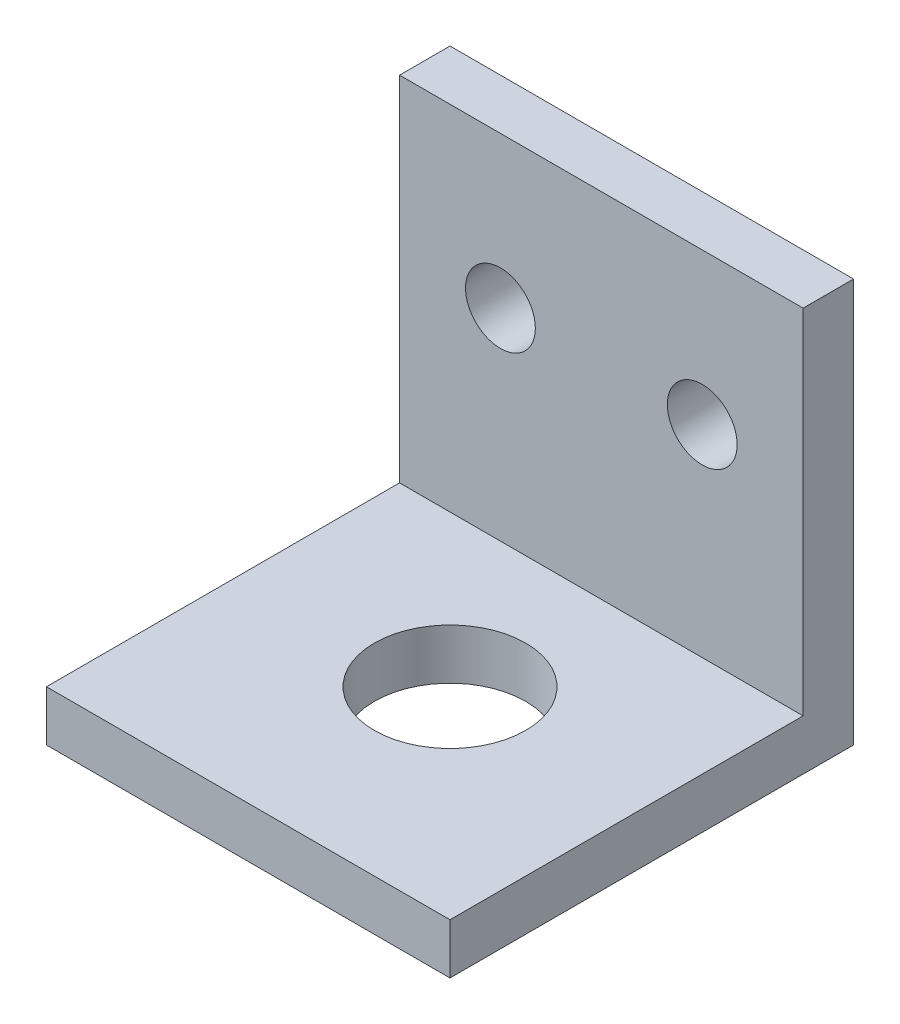
ISO-10303-21;
HEADER;
FILE_DESCRIPTION(('STEP AP214'),'2;1');
FILE_NAME('part.step','',(''),(''),'','','');
FILE_SCHEMA(('AUTOMOTIVE_DESIGN { 1 0 10303 214 1 1 1 1 }'));
ENDSEC;
DATA;
#1=APPLICATION_CONTEXT('core data for automotive mechanical design processes');
#2=APPLICATION_PROTOCOL_DEFINITION('international standard','automotive_design',2000,#1);
#3=PRODUCT_CONTEXT('',#1,'mechanical');
#4=PRODUCT('Part','Part','',(#3));
#5=PRODUCT_RELATED_PRODUCT_CATEGORY('part','',(#4));
#6=PRODUCT_DEFINITION_FORMATION('','',#4);
#7=PRODUCT_DEFINITION_CONTEXT('part definition',#1,'design');
#8=PRODUCT_DEFINITION('design','',#6,#7);
#9=PRODUCT_DEFINITION_SHAPE('','',#8);
#10=(LENGTH_UNIT() NAMED_UNIT(*) SI_UNIT(.MILLI.,.METRE.));
#11=(NAMED_UNIT(*) PLANE_ANGLE_UNIT() SI_UNIT($,.RADIAN.));
#12=(NAMED_UNIT(*) SI_UNIT($,.STERADIAN.) SOLID_ANGLE_UNIT());
#13=UNCERTAINTY_MEASURE_WITH_UNIT(LENGTH_MEASURE(1.E-05),#10,'distance_accuracy_value','');
#14=(GEOMETRIC_REPRESENTATION_CONTEXT(3) GLOBAL_UNCERTAINTY_ASSIGNED_CONTEXT((#13)) GLOBAL_UNIT_ASSIGNED_CONTEXT((#10,
#11,#12)) REPRESENTATION_CONTEXT('',''));
#15=CARTESIAN_POINT('',(0.,0.,0.));
#16=DIRECTION('',(0.,0.,1.));
#17=DIRECTION('',(1.,0.,0.));
#18=AXIS2_PLACEMENT_3D('',#15,#16,#17);
#19=CARTESIAN_POINT('',(-12.7,3.175,12.7));
#20=DIRECTION('',(-1.,0.,0.));
#21=DIRECTION('',(0.,0.,1.));
#22=AXIS2_PLACEMENT_3D('',#19,#20,#21);
#23=PLANE('',#22);
#24=DIRECTION('',(0.,0.,-1.));
#25=VECTOR('',#24,1.);
#26=CARTESIAN_POINT('',(-12.7,3.175,12.7));
#27=LINE('',#26,#25);
#28=CARTESIAN_POINT('',(-12.7,3.175,12.7));
#29=VERTEX_POINT('',#28);
#30=CARTESIAN_POINT('',(-12.7,3.175,-9.525));
#31=VERTEX_POINT('',#30);
#32=EDGE_CURVE('E87',#29,#31,#27,.T.);
#33=ORIENTED_EDGE('',*,*,#32,.T.);
#34=DIRECTION('',(0.,-1.,0.));
#35=VECTOR('',#34,1.);
#36=CARTESIAN_POINT('',(-12.7,25.4,-9.52500000000001));
#37=LINE('',#36,#35);
#38=CARTESIAN_POINT('',(-12.7,25.4,-9.52500000000001));
#39=VERTEX_POINT('',#38);
#40=EDGE_CURVE('E49',#39,#31,#37,.T.);
#41=ORIENTED_EDGE('',*,*,#40,.F.);
#42=DIRECTION('',(0.,0.,-1.));
#43=VECTOR('',#42,1.);
#44=CARTESIAN_POINT('',(-12.7,25.4,-12.7));
#45=LINE('',#44,#43);
#46=CARTESIAN_POINT('',(-12.7,25.4,-12.7));
#47=VERTEX_POINT('',#46);
#48=EDGE_CURVE('E118',#39,#47,#45,.T.);
#49=ORIENTED_EDGE('',*,*,#48,.T.);
#50=DIRECTION('',(0.,-1.,0.));
#51=VECTOR('',#50,1.);
#52=CARTESIAN_POINT('',(-12.7,3.175,-12.7));
#53=LINE('',#52,#51);
#54=CARTESIAN_POINT('',(-12.7,0.,-12.7));
#55=VERTEX_POINT('',#54);
#56=EDGE_CURVE('E36',#47,#55,#53,.T.);
#57=ORIENTED_EDGE('',*,*,#56,.T.);
#58=DIRECTION('',(0.,0.,-1.));
#59=VECTOR('',#58,1.);
#60=CARTESIAN_POINT('',(-12.7,0.,12.7));
#61=LINE('',#60,#59);
#62=CARTESIAN_POINT('',(-12.7,0.,12.7));
#63=VERTEX_POINT('',#62);
#64=EDGE_CURVE('E84',#63,#55,#61,.T.);
#65=ORIENTED_EDGE('',*,*,#64,.F.);
#66=DIRECTION('',(0.,-1.,0.));
#67=VECTOR('',#66,1.);
#68=CARTESIAN_POINT('',(-12.7,3.175,12.7));
#69=LINE('',#68,#67);
#70=EDGE_CURVE('E11',#29,#63,#69,.T.);
#71=ORIENTED_EDGE('',*,*,#70,.F.);
#72=EDGE_LOOP('',(#33,#41,#49,#57,#65,#71));
#73=FACE_BOUND('',#72,.T.);
#74=ADVANCED_FACE('F33',(#73),#23,.T.);
#75=CARTESIAN_POINT('',(-12.7,3.175,12.7));
#76=DIRECTION('',(0.,0.,-1.));
#77=DIRECTION('',(-1.,0.,0.));
#78=AXIS2_PLACEMENT_3D('',#75,#76,#77);
#79=PLANE('',#78);
#80=DIRECTION('',(1.,0.,0.));
#81=VECTOR('',#80,1.);
#82=CARTESIAN_POINT('',(-12.7,0.,12.7));
#83=LINE('',#82,#81);
#84=CARTESIAN_POINT('',(12.7,0.,12.7));
#85=VERTEX_POINT('',#84);
#86=EDGE_CURVE('E76',#63,#85,#83,.T.);
#87=ORIENTED_EDGE('',*,*,#86,.T.);
#88=DIRECTION('',(0.,-1.,0.));
#89=VECTOR('',#88,1.);
#90=CARTESIAN_POINT('',(12.7,3.175,12.7));
#91=LINE('',#90,#89);
#92=CARTESIAN_POINT('',(12.7,3.175,12.7));
#93=VERTEX_POINT('',#92);
#94=EDGE_CURVE('E41',#93,#85,#91,.T.);
#95=ORIENTED_EDGE('',*,*,#94,.F.);
#96=DIRECTION('',(1.,0.,0.));
#97=VECTOR('',#96,1.);
#98=CARTESIAN_POINT('',(-12.7,3.175,12.7));
#99=LINE('',#98,#97);
#100=EDGE_CURVE('E78',#29,#93,#99,.T.);
#101=ORIENTED_EDGE('',*,*,#100,.F.);
#102=ORIENTED_EDGE('',*,*,#70,.T.);
#103=EDGE_LOOP('',(#87,#95,#101,#102));
#104=FACE_BOUND('',#103,.T.);
#105=ADVANCED_FACE('F74',(#104),#79,.F.);
#106=CARTESIAN_POINT('',(12.7,3.175,12.7));
#107=DIRECTION('',(-1.,0.,0.));
#108=DIRECTION('',(0.,0.,1.));
#109=AXIS2_PLACEMENT_3D('',#106,#107,#108);
#110=PLANE('',#109);
#111=DIRECTION('',(0.,0.,-1.));
#112=VECTOR('',#111,1.);
#113=CARTESIAN_POINT('',(12.7,0.,12.7));
#114=LINE('',#113,#112);
#115=CARTESIAN_POINT('',(12.7,0.,-12.7));
#116=VERTEX_POINT('',#115);
#117=EDGE_CURVE('E86',#85,#116,#114,.T.);
#118=ORIENTED_EDGE('',*,*,#117,.T.);
#119=DIRECTION('',(0.,-1.,0.));
#120=VECTOR('',#119,1.);
#121=CARTESIAN_POINT('',(12.7,3.175,-12.7));
#122=LINE('',#121,#120);
#123=CARTESIAN_POINT('',(12.7,25.4,-12.7));
#124=VERTEX_POINT('',#123);
#125=EDGE_CURVE('E101',#124,#116,#122,.T.);
#126=ORIENTED_EDGE('',*,*,#125,.F.);
#127=DIRECTION('',(0.,0.,1.));
#128=VECTOR('',#127,1.);
#129=CARTESIAN_POINT('',(12.7,25.4,-12.7));
#130=LINE('',#129,#128);
#131=CARTESIAN_POINT('',(12.7,25.4,-9.525));
#132=VERTEX_POINT('',#131);
#133=EDGE_CURVE('E122',#124,#132,#130,.T.);
#134=ORIENTED_EDGE('',*,*,#133,.T.);
#135=DIRECTION('',(0.,-1.,0.));
#136=VECTOR('',#135,1.);
#137=CARTESIAN_POINT('',(12.7,25.4,-9.525));
#138=LINE('',#137,#136);
#139=CARTESIAN_POINT('',(12.7,3.175,-9.525));
#140=VERTEX_POINT('',#139);
#141=EDGE_CURVE('E112',#132,#140,#138,.T.);
#142=ORIENTED_EDGE('',*,*,#141,.T.);
#143=DIRECTION('',(0.,0.,-1.));
#144=VECTOR('',#143,1.);
#145=CARTESIAN_POINT('',(12.7,3.175,12.7));
#146=LINE('',#145,#144);
#147=EDGE_CURVE('E106',#93,#140,#146,.T.);
#148=ORIENTED_EDGE('',*,*,#147,.F.);
#149=ORIENTED_EDGE('',*,*,#94,.T.);
#150=EDGE_LOOP('',(#118,#126,#134,#142,#148,#149));
#151=FACE_BOUND('',#150,.T.);
#152=ADVANCED_FACE('F165',(#151),#110,.F.);
#153=CARTESIAN_POINT('',(-12.7,3.175,-12.7));
#154=DIRECTION('',(0.,0.,-1.));
#155=DIRECTION('',(-1.,0.,0.));
#156=AXIS2_PLACEMENT_3D('',#153,#154,#155);
#157=PLANE('',#156);
#158=CARTESIAN_POINT('',(-6.35,15.875,-12.7));
#159=DIRECTION('',(0.,0.,1.));
#160=DIRECTION('',(1.,0.,0.));
#161=AXIS2_PLACEMENT_3D('',#158,#159,#160);
#162=CIRCLE('',#161,2.1971);
#163=CARTESIAN_POINT('',(-4.1529,15.875,-12.7));
#164=VERTEX_POINT('',#163);
#165=EDGE_CURVE('E129',#164,#164,#162,.T.);
#166=ORIENTED_EDGE('',*,*,#165,.T.);
#167=EDGE_LOOP('',(#166));
#168=FACE_BOUND('',#167,.T.);
#169=CARTESIAN_POINT('',(6.35,15.875,-12.7));
#170=DIRECTION('',(0.,0.,1.));
#171=DIRECTION('',(-1.,0.,0.));
#172=AXIS2_PLACEMENT_3D('',#169,#170,#171);
#173=CIRCLE('',#172,2.1971);
#174=CARTESIAN_POINT('',(4.1529,15.875,-12.7));
#175=VERTEX_POINT('',#174);
#176=EDGE_CURVE('E135',#175,#175,#173,.T.);
#177=ORIENTED_EDGE('',*,*,#176,.T.);
#178=EDGE_LOOP('',(#177));
#179=FACE_BOUND('',#178,.T.);
#180=DIRECTION('',(1.,0.,0.));
#181=VECTOR('',#180,1.);
#182=CARTESIAN_POINT('',(-12.7,0.,-12.7));
#183=LINE('',#182,#181);
#184=EDGE_CURVE('E92',#55,#116,#183,.T.);
#185=ORIENTED_EDGE('',*,*,#184,.F.);
#186=ORIENTED_EDGE('',*,*,#56,.F.);
#187=DIRECTION('',(1.,0.,0.));
#188=VECTOR('',#187,1.);
#189=CARTESIAN_POINT('',(12.7,25.4,-12.7));
#190=LINE('',#189,#188);
#191=EDGE_CURVE('E115',#47,#124,#190,.T.);
#192=ORIENTED_EDGE('',*,*,#191,.T.);
#193=ORIENTED_EDGE('',*,*,#125,.T.);
#194=EDGE_LOOP('',(#185,#186,#192,#193));
#195=FACE_BOUND('',#194,.T.);
#196=ADVANCED_FACE('F144',(#168,#179,#195),#157,.T.);
#197=CARTESIAN_POINT('',(0.,3.175,0.));
#198=DIRECTION('',(0.,-1.,0.));
#199=DIRECTION('',(0.,0.,-1.));
#200=AXIS2_PLACEMENT_3D('',#197,#198,#199);
#201=PLANE('',#200);
#202=CARTESIAN_POINT('',(0.,3.175,0.));
#203=DIRECTION('',(0.,1.,0.));
#204=DIRECTION('',(0.,0.,1.));
#205=AXIS2_PLACEMENT_3D('',#202,#203,#204);
#206=CIRCLE('',#205,4.7625);
#207=CARTESIAN_POINT('',(0.,3.175,4.7625));
#208=VERTEX_POINT('',#207);
#209=EDGE_CURVE('E126',#208,#208,#206,.T.);
#210=ORIENTED_EDGE('',*,*,#209,.F.);
#211=EDGE_LOOP('',(#210));
#212=FACE_BOUND('',#211,.T.);
#213=ORIENTED_EDGE('',*,*,#147,.T.);
#214=DIRECTION('',(-1.,0.,0.));
#215=VECTOR('',#214,1.);
#216=CARTESIAN_POINT('',(0.,3.175,-9.525));
#217=LINE('',#216,#215);
#218=EDGE_CURVE('E93',#140,#31,#217,.T.);
#219=ORIENTED_EDGE('',*,*,#218,.T.);
#220=ORIENTED_EDGE('',*,*,#32,.F.);
#221=ORIENTED_EDGE('',*,*,#100,.T.);
#222=EDGE_LOOP('',(#213,#219,#220,#221));
#223=FACE_BOUND('',#222,.T.);
#224=ADVANCED_FACE('F176',(#212,#223),#201,.F.);
#225=CARTESIAN_POINT('',(0.,0.,0.));
#226=DIRECTION('',(0.,-1.,0.));
#227=DIRECTION('',(0.,0.,-1.));
#228=AXIS2_PLACEMENT_3D('',#225,#226,#227);
#229=PLANE('',#228);
#230=CARTESIAN_POINT('',(0.,0.,0.));
#231=DIRECTION('',(0.,1.,0.));
#232=DIRECTION('',(0.,0.,1.));
#233=AXIS2_PLACEMENT_3D('',#230,#231,#232);
#234=CIRCLE('',#233,4.7625);
#235=CARTESIAN_POINT('',(0.,0.,4.7625));
#236=VERTEX_POINT('',#235);
#237=EDGE_CURVE('E125',#236,#236,#234,.T.);
#238=ORIENTED_EDGE('',*,*,#237,.T.);
#239=EDGE_LOOP('',(#238));
#240=FACE_BOUND('',#239,.T.);
#241=ORIENTED_EDGE('',*,*,#64,.T.);
#242=ORIENTED_EDGE('',*,*,#184,.T.);
#243=ORIENTED_EDGE('',*,*,#117,.F.);
#244=ORIENTED_EDGE('',*,*,#86,.F.);
#245=EDGE_LOOP('',(#241,#242,#243,#244));
#246=FACE_BOUND('',#245,.T.);
#247=ADVANCED_FACE('F82',(#240,#246),#229,.T.);
#248=CARTESIAN_POINT('',(12.7,25.4,-9.525));
#249=DIRECTION('',(0.,0.,1.));
#250=DIRECTION('',(1.,0.,0.));
#251=AXIS2_PLACEMENT_3D('',#248,#249,#250);
#252=PLANE('',#251);
#253=CARTESIAN_POINT('',(-6.35,15.875,-9.525));
#254=DIRECTION('',(0.,0.,1.));
#255=DIRECTION('',(1.,0.,0.));
#256=AXIS2_PLACEMENT_3D('',#253,#254,#255);
#257=CIRCLE('',#256,2.1971);
#258=CARTESIAN_POINT('',(-4.1529,15.875,-9.525));
#259=VERTEX_POINT('',#258);
#260=EDGE_CURVE('E138',#259,#259,#257,.T.);
#261=ORIENTED_EDGE('',*,*,#260,.F.);
#262=EDGE_LOOP('',(#261));
#263=FACE_BOUND('',#262,.T.);
#264=CARTESIAN_POINT('',(6.35,15.875,-9.525));
#265=DIRECTION('',(0.,0.,1.));
#266=DIRECTION('',(-1.,0.,0.));
#267=AXIS2_PLACEMENT_3D('',#264,#265,#266);
#268=CIRCLE('',#267,2.1971);
#269=CARTESIAN_POINT('',(4.1529,15.875,-9.525));
#270=VERTEX_POINT('',#269);
#271=EDGE_CURVE('E132',#270,#270,#268,.T.);
#272=ORIENTED_EDGE('',*,*,#271,.F.);
#273=EDGE_LOOP('',(#272));
#274=FACE_BOUND('',#273,.T.);
#275=ORIENTED_EDGE('',*,*,#218,.F.);
#276=ORIENTED_EDGE('',*,*,#141,.F.);
#277=DIRECTION('',(-1.,0.,0.));
#278=VECTOR('',#277,1.);
#279=CARTESIAN_POINT('',(12.7,25.4,-9.525));
#280=LINE('',#279,#278);
#281=EDGE_CURVE('E120',#132,#39,#280,.T.);
#282=ORIENTED_EDGE('',*,*,#281,.T.);
#283=ORIENTED_EDGE('',*,*,#40,.T.);
#284=EDGE_LOOP('',(#275,#276,#282,#283));
#285=FACE_BOUND('',#284,.T.);
#286=ADVANCED_FACE('F154',(#263,#274,#285),#252,.T.);
#287=CARTESIAN_POINT('',(0.,25.4,0.));
#288=DIRECTION('',(0.,-1.,0.));
#289=DIRECTION('',(0.,0.,-1.));
#290=AXIS2_PLACEMENT_3D('',#287,#288,#289);
#291=PLANE('',#290);
#292=ORIENTED_EDGE('',*,*,#133,.F.);
#293=ORIENTED_EDGE('',*,*,#191,.F.);
#294=ORIENTED_EDGE('',*,*,#48,.F.);
#295=ORIENTED_EDGE('',*,*,#281,.F.);
#296=EDGE_LOOP('',(#292,#293,#294,#295));
#297=FACE_BOUND('',#296,.T.);
#298=ADVANCED_FACE('F157',(#297),#291,.F.);
#299=CARTESIAN_POINT('',(0.,0.,0.));
#300=DIRECTION('',(0.,1.,0.));
#301=DIRECTION('',(0.,0.,1.));
#302=AXIS2_PLACEMENT_3D('',#299,#300,#301);
#303=CYLINDRICAL_SURFACE('',#302,4.7625);
#304=ORIENTED_EDGE('',*,*,#237,.F.);
#305=EDGE_LOOP('',(#304));
#306=FACE_BOUND('',#305,.T.);
#307=ORIENTED_EDGE('',*,*,#209,.T.);
#308=EDGE_LOOP('',(#307));
#309=FACE_BOUND('',#308,.T.);
#310=ADVANCED_FACE('F211',(#306,#309),#303,.F.);
#311=CARTESIAN_POINT('',(6.35,15.875,-12.7));
#312=DIRECTION('',(0.,0.,1.));
#313=DIRECTION('',(1.,0.,0.));
#314=AXIS2_PLACEMENT_3D('',#311,#312,#313);
#315=CYLINDRICAL_SURFACE('',#314,2.1971);
#316=ORIENTED_EDGE('',*,*,#176,.F.);
#317=EDGE_LOOP('',(#316));
#318=FACE_BOUND('',#317,.T.);
#319=ORIENTED_EDGE('',*,*,#271,.T.);
#320=EDGE_LOOP('',(#319));
#321=FACE_BOUND('',#320,.T.);
#322=ADVANCED_FACE('F150',(#318,#321),#315,.F.);
#323=CARTESIAN_POINT('',(-6.35,15.875,-12.7));
#324=DIRECTION('',(0.,0.,1.));
#325=DIRECTION('',(1.,0.,0.));
#326=AXIS2_PLACEMENT_3D('',#323,#324,#325);
#327=CYLINDRICAL_SURFACE('',#326,2.1971);
#328=ORIENTED_EDGE('',*,*,#165,.F.);
#329=EDGE_LOOP('',(#328));
#330=FACE_BOUND('',#329,.T.);
#331=ORIENTED_EDGE('',*,*,#260,.T.);
#332=EDGE_LOOP('',(#331));
#333=FACE_BOUND('',#332,.T.);
#334=ADVANCED_FACE('F147',(#330,#333),#327,.F.);
#335=CLOSED_SHELL('',(#74,#105,#152,#196,#224,#247,#286,#298,#310,#322,#334));
#336=MANIFOLD_SOLID_BREP('B2',#335);
#337=ADVANCED_BREP_SHAPE_REPRESENTATION('',(#18,#336),#14);
#338=SHAPE_DEFINITION_REPRESENTATION(#9,#337);
ENDSEC;
END-ISO-10303-21;
